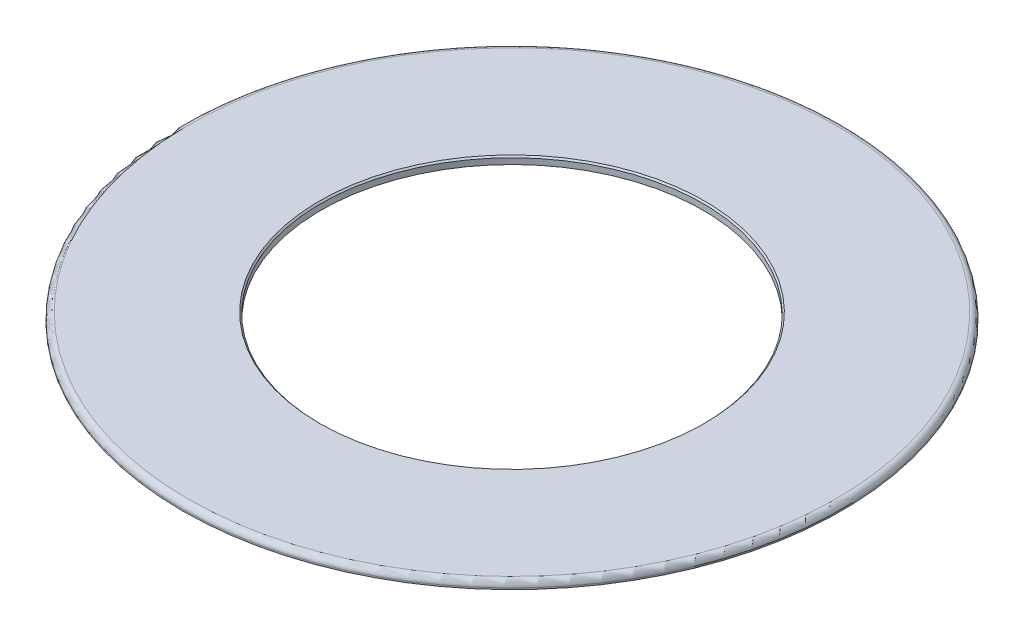
ISO-10303-21;
HEADER;
FILE_DESCRIPTION(('STEP AP214'),'2;1');
FILE_NAME('part.step','',(''),(''),'','','');
FILE_SCHEMA(('AUTOMOTIVE_DESIGN { 1 0 10303 214 1 1 1 1 }'));
ENDSEC;
DATA;
#1=APPLICATION_CONTEXT('core data for automotive mechanical design processes');
#2=APPLICATION_PROTOCOL_DEFINITION('international standard','automotive_design',2000,#1);
#3=PRODUCT_CONTEXT('',#1,'mechanical');
#4=PRODUCT('Part','Part','',(#3));
#5=PRODUCT_RELATED_PRODUCT_CATEGORY('part','',(#4));
#6=PRODUCT_DEFINITION_FORMATION('','',#4);
#7=PRODUCT_DEFINITION_CONTEXT('part definition',#1,'design');
#8=PRODUCT_DEFINITION('design','',#6,#7);
#9=PRODUCT_DEFINITION_SHAPE('','',#8);
#10=(LENGTH_UNIT() NAMED_UNIT(*) SI_UNIT(.MILLI.,.METRE.));
#11=(NAMED_UNIT(*) PLANE_ANGLE_UNIT() SI_UNIT($,.RADIAN.));
#12=(NAMED_UNIT(*) SI_UNIT($,.STERADIAN.) SOLID_ANGLE_UNIT());
#13=UNCERTAINTY_MEASURE_WITH_UNIT(LENGTH_MEASURE(1.E-05),#10,'distance_accuracy_value','');
#14=(GEOMETRIC_REPRESENTATION_CONTEXT(3) GLOBAL_UNCERTAINTY_ASSIGNED_CONTEXT((#13)) GLOBAL_UNIT_ASSIGNED_CONTEXT((#10,
#11,#12)) REPRESENTATION_CONTEXT('',''));
#15=CARTESIAN_POINT('',(0.,0.,0.));
#16=DIRECTION('',(0.,0.,1.));
#17=DIRECTION('',(1.,0.,0.));
#18=AXIS2_PLACEMENT_3D('',#15,#16,#17);
#19=CARTESIAN_POINT('',(350.,5.,700.));
#20=DIRECTION('',(0.,1.,0.));
#21=DIRECTION('',(0.,0.,1.));
#22=AXIS2_PLACEMENT_3D('',#19,#20,#21);
#23=PLANE('',#22);
#24=CARTESIAN_POINT('',(350.,5.,700.));
#25=DIRECTION('',(0.,1.,0.));
#26=DIRECTION('',(0.,0.,1.));
#27=AXIS2_PLACEMENT_3D('',#24,#25,#26);
#28=CIRCLE('',#27,221.);
#29=CARTESIAN_POINT('',(350.,5.,921.));
#30=VERTEX_POINT('',#29);
#31=EDGE_CURVE('E37',#30,#30,#28,.T.);
#32=ORIENTED_EDGE('',*,*,#31,.T.);
#33=EDGE_LOOP('',(#32));
#34=FACE_BOUND('',#33,.T.);
#35=CARTESIAN_POINT('',(350.,5.,700.));
#36=DIRECTION('',(0.,1.,0.));
#37=DIRECTION('',(0.,0.,1.));
#38=AXIS2_PLACEMENT_3D('',#35,#36,#37);
#39=CIRCLE('',#38,131.500000000001);
#40=CARTESIAN_POINT('',(350.,5.,831.5));
#41=VERTEX_POINT('',#40);
#42=EDGE_CURVE('E41',#41,#41,#39,.F.);
#43=ORIENTED_EDGE('',*,*,#42,.T.);
#44=EDGE_LOOP('',(#43));
#45=FACE_BOUND('',#44,.T.);
#46=ADVANCED_FACE('F30',(#34,#45),#23,.T.);
#47=CARTESIAN_POINT('',(350.,0.,700.));
#48=DIRECTION('',(0.,1.,0.));
#49=DIRECTION('',(0.,0.,1.));
#50=AXIS2_PLACEMENT_3D('',#47,#48,#49);
#51=PLANE('',#50);
#52=CARTESIAN_POINT('',(350.,0.,700.));
#53=DIRECTION('',(0.,1.,0.));
#54=DIRECTION('',(0.,0.,1.));
#55=AXIS2_PLACEMENT_3D('',#52,#53,#54);
#56=CIRCLE('',#55,225.);
#57=CARTESIAN_POINT('',(350.,0.,925.));
#58=VERTEX_POINT('',#57);
#59=EDGE_CURVE('E50',#58,#58,#56,.T.);
#60=ORIENTED_EDGE('',*,*,#59,.F.);
#61=EDGE_LOOP('',(#60));
#62=FACE_BOUND('',#61,.T.);
#63=CARTESIAN_POINT('',(350.,0.,700.));
#64=DIRECTION('',(0.,1.,0.));
#65=DIRECTION('',(0.,0.,1.));
#66=AXIS2_PLACEMENT_3D('',#63,#64,#65);
#67=CIRCLE('',#66,130.5);
#68=CARTESIAN_POINT('',(350.,0.,830.5));
#69=VERTEX_POINT('',#68);
#70=EDGE_CURVE('E53',#69,#69,#67,.T.);
#71=ORIENTED_EDGE('',*,*,#70,.T.);
#72=EDGE_LOOP('',(#71));
#73=FACE_BOUND('',#72,.T.);
#74=ADVANCED_FACE('F57',(#62,#73),#51,.F.);
#75=CARTESIAN_POINT('',(350.,5.,700.));
#76=DIRECTION('',(0.,-1.,0.));
#77=DIRECTION('',(0.,0.,-1.));
#78=AXIS2_PLACEMENT_3D('',#75,#76,#77);
#79=CYLINDRICAL_SURFACE('',#78,225.);
#80=CARTESIAN_POINT('',(350.,1.,700.));
#81=DIRECTION('',(0.,1.,0.));
#82=DIRECTION('',(0.,0.,1.));
#83=AXIS2_PLACEMENT_3D('',#80,#81,#82);
#84=CIRCLE('',#83,225.);
#85=CARTESIAN_POINT('',(350.,1.,925.));
#86=VERTEX_POINT('',#85);
#87=EDGE_CURVE('E10',#86,#86,#84,.F.);
#88=ORIENTED_EDGE('',*,*,#87,.T.);
#89=EDGE_LOOP('',(#88));
#90=FACE_BOUND('',#89,.T.);
#91=ORIENTED_EDGE('',*,*,#59,.T.);
#92=EDGE_LOOP('',(#91));
#93=FACE_BOUND('',#92,.T.);
#94=ADVANCED_FACE('F62',(#90,#93),#79,.T.);
#95=CARTESIAN_POINT('',(350.,5.,700.));
#96=DIRECTION('',(0.,-1.,0.));
#97=DIRECTION('',(0.,0.,-1.));
#98=AXIS2_PLACEMENT_3D('',#95,#96,#97);
#99=CYLINDRICAL_SURFACE('',#98,130.5);
#100=CARTESIAN_POINT('',(350.,3.99999999999997,700.));
#101=DIRECTION('',(0.,1.,0.));
#102=DIRECTION('',(0.,0.,1.));
#103=AXIS2_PLACEMENT_3D('',#100,#101,#102);
#104=CIRCLE('',#103,130.5);
#105=CARTESIAN_POINT('',(350.,3.99999999999997,830.5));
#106=VERTEX_POINT('',#105);
#107=EDGE_CURVE('E45',#106,#106,#104,.T.);
#108=ORIENTED_EDGE('',*,*,#107,.T.);
#109=EDGE_LOOP('',(#108));
#110=FACE_BOUND('',#109,.T.);
#111=ORIENTED_EDGE('',*,*,#70,.F.);
#112=EDGE_LOOP('',(#111));
#113=FACE_BOUND('',#112,.T.);
#114=ADVANCED_FACE('F59',(#110,#113),#99,.F.);
#115=CARTESIAN_POINT('',(350.,3.99999999999997,700.));
#116=DIRECTION('',(0.,1.,0.));
#117=DIRECTION('',(0.,0.,1.));
#118=AXIS2_PLACEMENT_3D('',#115,#116,#117);
#119=CONICAL_SURFACE('',#118,130.5,0.785398163397504);
#120=ORIENTED_EDGE('',*,*,#42,.F.);
#121=EDGE_LOOP('',(#120));
#122=FACE_BOUND('',#121,.T.);
#123=ORIENTED_EDGE('',*,*,#107,.F.);
#124=EDGE_LOOP('',(#123));
#125=FACE_BOUND('',#124,.T.);
#126=ADVANCED_FACE('F61',(#122,#125),#119,.F.);
#127=CARTESIAN_POINT('',(350.,1.,700.));
#128=DIRECTION('',(0.,1.,0.));
#129=DIRECTION('',(0.,0.,1.));
#130=AXIS2_PLACEMENT_3D('',#127,#128,#129);
#131=TOROIDAL_SURFACE('',#130,221.,4.);
#132=ORIENTED_EDGE('',*,*,#87,.F.);
#133=EDGE_LOOP('',(#132));
#134=FACE_BOUND('',#133,.T.);
#135=ORIENTED_EDGE('',*,*,#31,.F.);
#136=EDGE_LOOP('',(#135));
#137=FACE_BOUND('',#136,.T.);
#138=ADVANCED_FACE('F32',(#134,#137),#131,.T.);
#139=CLOSED_SHELL('',(#46,#74,#94,#114,#126,#138));
#140=MANIFOLD_SOLID_BREP('B2',#139);
#141=ADVANCED_BREP_SHAPE_REPRESENTATION('',(#18,#140),#14);
#142=SHAPE_DEFINITION_REPRESENTATION(#9,#141);
ENDSEC;
END-ISO-10303-21;
